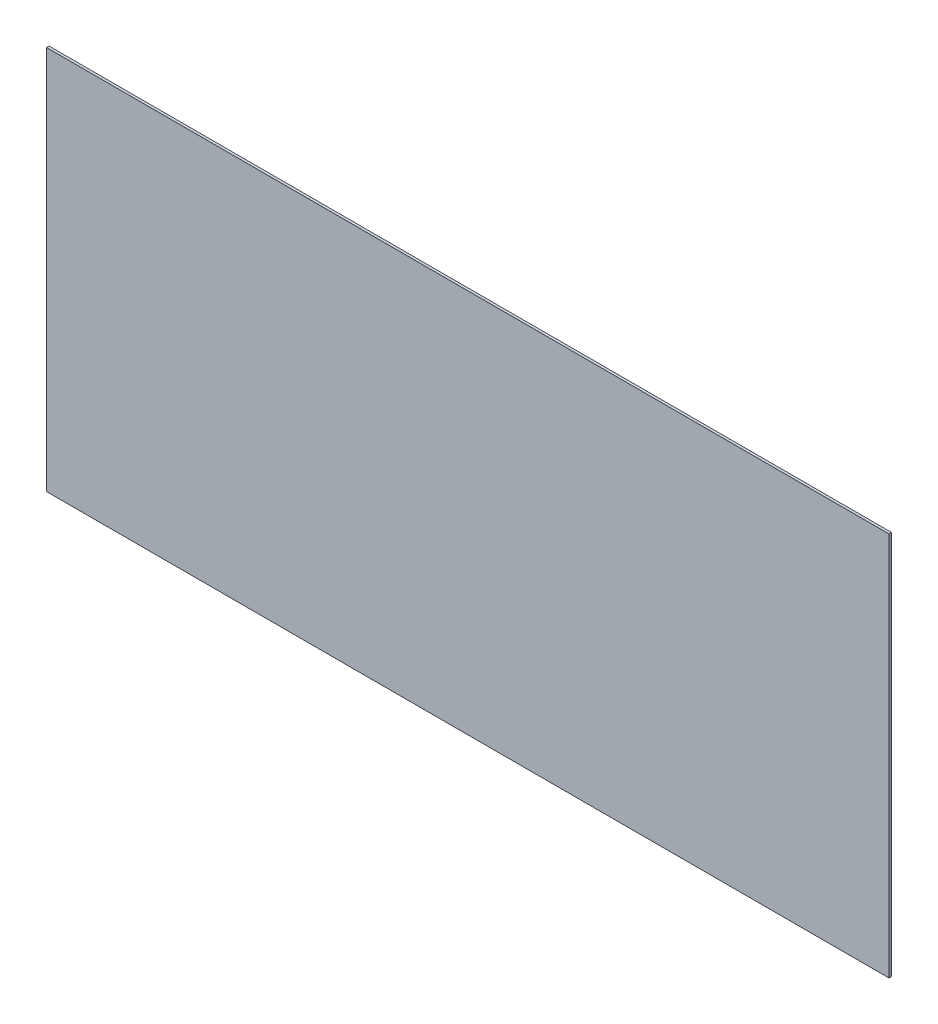
ISO-10303-21;
HEADER;
FILE_DESCRIPTION(('STEP AP214'),'2;1');
FILE_NAME('part.step','',(''),(''),'','','');
FILE_SCHEMA(('AUTOMOTIVE_DESIGN { 1 0 10303 214 1 1 1 1 }'));
ENDSEC;
DATA;
#1=APPLICATION_CONTEXT('core data for automotive mechanical design processes');
#2=APPLICATION_PROTOCOL_DEFINITION('international standard','automotive_design',2000,#1);
#3=PRODUCT_CONTEXT('',#1,'mechanical');
#4=PRODUCT('Part','Part','',(#3));
#5=PRODUCT_RELATED_PRODUCT_CATEGORY('part','',(#4));
#6=PRODUCT_DEFINITION_FORMATION('','',#4);
#7=PRODUCT_DEFINITION_CONTEXT('part definition',#1,'design');
#8=PRODUCT_DEFINITION('design','',#6,#7);
#9=PRODUCT_DEFINITION_SHAPE('','',#8);
#10=(LENGTH_UNIT() NAMED_UNIT(*) SI_UNIT(.MILLI.,.METRE.));
#11=(NAMED_UNIT(*) PLANE_ANGLE_UNIT() SI_UNIT($,.RADIAN.));
#12=(NAMED_UNIT(*) SI_UNIT($,.STERADIAN.) SOLID_ANGLE_UNIT());
#13=UNCERTAINTY_MEASURE_WITH_UNIT(LENGTH_MEASURE(1.E-05),#10,'distance_accuracy_value','');
#14=(GEOMETRIC_REPRESENTATION_CONTEXT(3) GLOBAL_UNCERTAINTY_ASSIGNED_CONTEXT((#13)) GLOBAL_UNIT_ASSIGNED_CONTEXT((#10,
#11,#12)) REPRESENTATION_CONTEXT('',''));
#15=CARTESIAN_POINT('',(0.,0.,0.));
#16=DIRECTION('',(0.,0.,1.));
#17=DIRECTION('',(1.,0.,0.));
#18=AXIS2_PLACEMENT_3D('',#15,#16,#17);
#19=CARTESIAN_POINT('',(495.3,226.06,2.9972));
#20=DIRECTION('',(-1.,0.,0.));
#21=DIRECTION('',(0.,-1.,0.));
#22=AXIS2_PLACEMENT_3D('',#19,#20,#21);
#23=PLANE('',#22);
#24=DIRECTION('',(0.,1.,0.));
#25=VECTOR('',#24,1.);
#26=CARTESIAN_POINT('',(495.3,226.06,0.));
#27=LINE('',#26,#25);
#28=CARTESIAN_POINT('',(495.3,-226.06,0.));
#29=VERTEX_POINT('',#28);
#30=CARTESIAN_POINT('',(495.3,226.06,0.));
#31=VERTEX_POINT('',#30);
#32=EDGE_CURVE('E107',#29,#31,#27,.T.);
#33=ORIENTED_EDGE('',*,*,#32,.T.);
#34=DIRECTION('',(0.,0.,-1.));
#35=VECTOR('',#34,1.);
#36=CARTESIAN_POINT('',(495.3,226.06,2.9972));
#37=LINE('',#36,#35);
#38=CARTESIAN_POINT('',(495.3,226.06,2.9972));
#39=VERTEX_POINT('',#38);
#40=EDGE_CURVE('E11',#39,#31,#37,.T.);
#41=ORIENTED_EDGE('',*,*,#40,.F.);
#42=DIRECTION('',(0.,1.,0.));
#43=VECTOR('',#42,1.);
#44=CARTESIAN_POINT('',(495.3,226.06,2.9972));
#45=LINE('',#44,#43);
#46=CARTESIAN_POINT('',(495.3,-226.06,2.9972));
#47=VERTEX_POINT('',#46);
#48=EDGE_CURVE('E91',#47,#39,#45,.T.);
#49=ORIENTED_EDGE('',*,*,#48,.F.);
#50=DIRECTION('',(0.,0.,-1.));
#51=VECTOR('',#50,1.);
#52=CARTESIAN_POINT('',(495.3,-226.06,2.9972));
#53=LINE('',#52,#51);
#54=EDGE_CURVE('E103',#47,#29,#53,.T.);
#55=ORIENTED_EDGE('',*,*,#54,.T.);
#56=EDGE_LOOP('',(#33,#41,#49,#55));
#57=FACE_BOUND('',#56,.T.);
#58=ADVANCED_FACE('F39',(#57),#23,.F.);
#59=CARTESIAN_POINT('',(-495.3,226.06,2.9972));
#60=DIRECTION('',(0.,-1.,0.));
#61=DIRECTION('',(0.,0.,-1.));
#62=AXIS2_PLACEMENT_3D('',#59,#60,#61);
#63=PLANE('',#62);
#64=DIRECTION('',(-1.,0.,0.));
#65=VECTOR('',#64,1.);
#66=CARTESIAN_POINT('',(-495.3,226.06,0.));
#67=LINE('',#66,#65);
#68=CARTESIAN_POINT('',(-495.3,226.06,0.));
#69=VERTEX_POINT('',#68);
#70=EDGE_CURVE('E96',#31,#69,#67,.T.);
#71=ORIENTED_EDGE('',*,*,#70,.T.);
#72=DIRECTION('',(0.,0.,-1.));
#73=VECTOR('',#72,1.);
#74=CARTESIAN_POINT('',(-495.3,226.06,2.9972));
#75=LINE('',#74,#73);
#76=CARTESIAN_POINT('',(-495.3,226.06,2.9972));
#77=VERTEX_POINT('',#76);
#78=EDGE_CURVE('E48',#77,#69,#75,.T.);
#79=ORIENTED_EDGE('',*,*,#78,.F.);
#80=DIRECTION('',(-1.,0.,0.));
#81=VECTOR('',#80,1.);
#82=CARTESIAN_POINT('',(-495.3,226.06,2.9972));
#83=LINE('',#82,#81);
#84=EDGE_CURVE('E86',#39,#77,#83,.T.);
#85=ORIENTED_EDGE('',*,*,#84,.F.);
#86=ORIENTED_EDGE('',*,*,#40,.T.);
#87=EDGE_LOOP('',(#71,#79,#85,#86));
#88=FACE_BOUND('',#87,.T.);
#89=ADVANCED_FACE('F95',(#88),#63,.F.);
#90=CARTESIAN_POINT('',(-495.3,226.06,2.9972));
#91=DIRECTION('',(1.,0.,0.));
#92=DIRECTION('',(0.,1.,0.));
#93=AXIS2_PLACEMENT_3D('',#90,#91,#92);
#94=PLANE('',#93);
#95=DIRECTION('',(0.,-1.,0.));
#96=VECTOR('',#95,1.);
#97=CARTESIAN_POINT('',(-495.3,226.06,0.));
#98=LINE('',#97,#96);
#99=CARTESIAN_POINT('',(-495.3,-226.06,0.));
#100=VERTEX_POINT('',#99);
#101=EDGE_CURVE('E73',#69,#100,#98,.T.);
#102=ORIENTED_EDGE('',*,*,#101,.T.);
#103=DIRECTION('',(0.,0.,-1.));
#104=VECTOR('',#103,1.);
#105=CARTESIAN_POINT('',(-495.3,-226.06,2.9972));
#106=LINE('',#105,#104);
#107=CARTESIAN_POINT('',(-495.3,-226.06,2.9972));
#108=VERTEX_POINT('',#107);
#109=EDGE_CURVE('E98',#108,#100,#106,.T.);
#110=ORIENTED_EDGE('',*,*,#109,.F.);
#111=DIRECTION('',(0.,-1.,0.));
#112=VECTOR('',#111,1.);
#113=CARTESIAN_POINT('',(-495.3,226.06,2.9972));
#114=LINE('',#113,#112);
#115=EDGE_CURVE('E89',#77,#108,#114,.T.);
#116=ORIENTED_EDGE('',*,*,#115,.F.);
#117=ORIENTED_EDGE('',*,*,#78,.T.);
#118=EDGE_LOOP('',(#102,#110,#116,#117));
#119=FACE_BOUND('',#118,.T.);
#120=ADVANCED_FACE('F99',(#119),#94,.F.);
#121=CARTESIAN_POINT('',(-495.3,-226.06,2.9972));
#122=DIRECTION('',(0.,1.,0.));
#123=DIRECTION('',(0.,0.,1.));
#124=AXIS2_PLACEMENT_3D('',#121,#122,#123);
#125=PLANE('',#124);
#126=DIRECTION('',(1.,0.,0.));
#127=VECTOR('',#126,1.);
#128=CARTESIAN_POINT('',(-495.3,-226.06,0.));
#129=LINE('',#128,#127);
#130=EDGE_CURVE('E79',#100,#29,#129,.T.);
#131=ORIENTED_EDGE('',*,*,#130,.T.);
#132=ORIENTED_EDGE('',*,*,#54,.F.);
#133=DIRECTION('',(1.,0.,0.));
#134=VECTOR('',#133,1.);
#135=CARTESIAN_POINT('',(-495.3,-226.06,2.9972));
#136=LINE('',#135,#134);
#137=EDGE_CURVE('E56',#108,#47,#136,.T.);
#138=ORIENTED_EDGE('',*,*,#137,.F.);
#139=ORIENTED_EDGE('',*,*,#109,.T.);
#140=EDGE_LOOP('',(#131,#132,#138,#139));
#141=FACE_BOUND('',#140,.T.);
#142=ADVANCED_FACE('F120',(#141),#125,.F.);
#143=CARTESIAN_POINT('',(0.,0.,2.9972));
#144=DIRECTION('',(0.,0.,1.));
#145=DIRECTION('',(1.,0.,0.));
#146=AXIS2_PLACEMENT_3D('',#143,#144,#145);
#147=PLANE('',#146);
#148=ORIENTED_EDGE('',*,*,#48,.T.);
#149=ORIENTED_EDGE('',*,*,#84,.T.);
#150=ORIENTED_EDGE('',*,*,#115,.T.);
#151=ORIENTED_EDGE('',*,*,#137,.T.);
#152=EDGE_LOOP('',(#148,#149,#150,#151));
#153=FACE_BOUND('',#152,.T.);
#154=ADVANCED_FACE('F87',(#153),#147,.T.);
#155=CARTESIAN_POINT('',(0.,0.,0.));
#156=DIRECTION('',(0.,0.,1.));
#157=DIRECTION('',(1.,0.,0.));
#158=AXIS2_PLACEMENT_3D('',#155,#156,#157);
#159=PLANE('',#158);
#160=ORIENTED_EDGE('',*,*,#32,.F.);
#161=ORIENTED_EDGE('',*,*,#130,.F.);
#162=ORIENTED_EDGE('',*,*,#101,.F.);
#163=ORIENTED_EDGE('',*,*,#70,.F.);
#164=EDGE_LOOP('',(#160,#161,#162,#163));
#165=FACE_BOUND('',#164,.T.);
#166=ADVANCED_FACE('F123',(#165),#159,.F.);
#167=CLOSED_SHELL('',(#58,#89,#120,#142,#154,#166));
#168=MANIFOLD_SOLID_BREP('B2',#167);
#169=ADVANCED_BREP_SHAPE_REPRESENTATION('',(#18,#168),#14);
#170=SHAPE_DEFINITION_REPRESENTATION(#9,#169);
ENDSEC;
END-ISO-10303-21;
